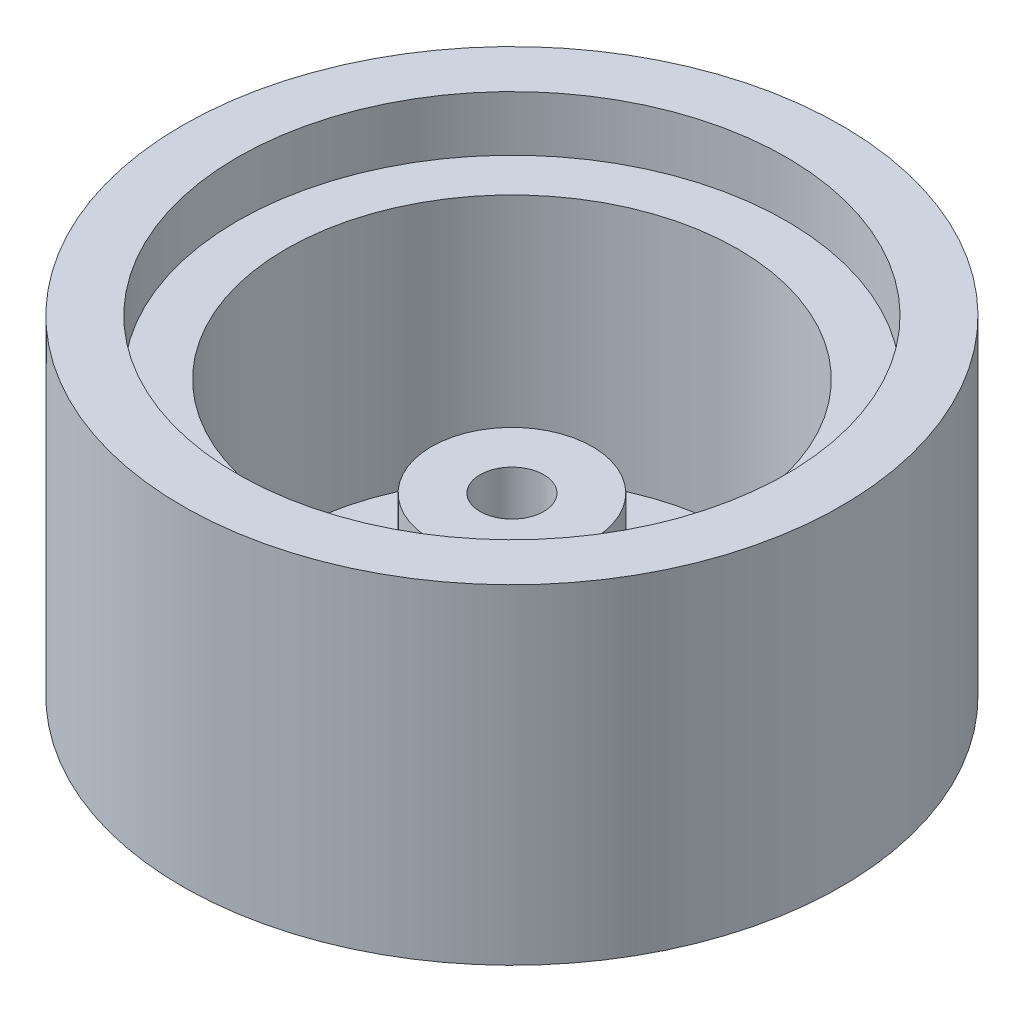
ISO-10303-21;
HEADER;
FILE_DESCRIPTION(('STEP AP214'),'2;1');
FILE_NAME('part.step','',(''),(''),'','','');
FILE_SCHEMA(('AUTOMOTIVE_DESIGN { 1 0 10303 214 1 1 1 1 }'));
ENDSEC;
DATA;
#1=APPLICATION_CONTEXT('core data for automotive mechanical design processes');
#2=APPLICATION_PROTOCOL_DEFINITION('international standard','automotive_design',2000,#1);
#3=PRODUCT_CONTEXT('',#1,'mechanical');
#4=PRODUCT('Part','Part','',(#3));
#5=PRODUCT_RELATED_PRODUCT_CATEGORY('part','',(#4));
#6=PRODUCT_DEFINITION_FORMATION('','',#4);
#7=PRODUCT_DEFINITION_CONTEXT('part definition',#1,'design');
#8=PRODUCT_DEFINITION('design','',#6,#7);
#9=PRODUCT_DEFINITION_SHAPE('','',#8);
#10=(LENGTH_UNIT() NAMED_UNIT(*) SI_UNIT(.MILLI.,.METRE.));
#11=(NAMED_UNIT(*) PLANE_ANGLE_UNIT() SI_UNIT($,.RADIAN.));
#12=(NAMED_UNIT(*) SI_UNIT($,.STERADIAN.) SOLID_ANGLE_UNIT());
#13=UNCERTAINTY_MEASURE_WITH_UNIT(LENGTH_MEASURE(1.E-05),#10,'distance_accuracy_value','');
#14=(GEOMETRIC_REPRESENTATION_CONTEXT(3) GLOBAL_UNCERTAINTY_ASSIGNED_CONTEXT((#13)) GLOBAL_UNIT_ASSIGNED_CONTEXT((#10,
#11,#12)) REPRESENTATION_CONTEXT('',''));
#15=CARTESIAN_POINT('',(0.,0.,0.));
#16=DIRECTION('',(0.,0.,1.));
#17=DIRECTION('',(1.,0.,0.));
#18=AXIS2_PLACEMENT_3D('',#15,#16,#17);
#19=CARTESIAN_POINT('',(0.,55.6945274823875,0.));
#20=DIRECTION('',(0.,1.,0.));
#21=DIRECTION('',(-1.,0.,0.));
#22=AXIS2_PLACEMENT_3D('',#19,#20,#21);
#23=CYLINDRICAL_SURFACE('',#22,2.95);
#24=CARTESIAN_POINT('',(0.,-13.1921209449324,0.));
#25=DIRECTION('',(0.,1.,0.));
#26=DIRECTION('',(-1.,0.,0.));
#27=AXIS2_PLACEMENT_3D('',#24,#25,#26);
#28=CIRCLE('',#27,2.95);
#29=CARTESIAN_POINT('',(-2.94999999999999,-13.1921209449324,0.));
#30=VERTEX_POINT('',#29);
#31=EDGE_CURVE('E10',#30,#30,#28,.T.);
#32=ORIENTED_EDGE('',*,*,#31,.F.);
#33=EDGE_LOOP('',(#32));
#34=FACE_BOUND('',#33,.T.);
#35=CARTESIAN_POINT('',(0.,3.08787905506758,0.));
#36=DIRECTION('',(0.,1.,0.));
#37=DIRECTION('',(-1.,0.,0.));
#38=AXIS2_PLACEMENT_3D('',#35,#36,#37);
#39=CIRCLE('',#38,2.94999999999999);
#40=CARTESIAN_POINT('',(-2.94999999999998,3.08787905506758,0.));
#41=VERTEX_POINT('',#40);
#42=EDGE_CURVE('E67',#41,#41,#39,.T.);
#43=ORIENTED_EDGE('',*,*,#42,.T.);
#44=EDGE_LOOP('',(#43));
#45=FACE_BOUND('',#44,.T.);
#46=ADVANCED_FACE('F33',(#34,#45),#23,.F.);
#47=CARTESIAN_POINT('',(2.95000000000001,-13.1921209449324,0.));
#48=DIRECTION('',(0.,1.,0.));
#49=DIRECTION('',(-1.,0.,0.));
#50=AXIS2_PLACEMENT_3D('',#47,#48,#49);
#51=PLANE('',#50);
#52=CARTESIAN_POINT('',(0.,-13.1921209449324,0.));
#53=DIRECTION('',(0.,1.,0.));
#54=DIRECTION('',(-1.,0.,0.));
#55=AXIS2_PLACEMENT_3D('',#52,#53,#54);
#56=CIRCLE('',#55,30.5);
#57=CARTESIAN_POINT('',(-30.5,-13.1921209449324,0.));
#58=VERTEX_POINT('',#57);
#59=EDGE_CURVE('E39',#58,#58,#56,.T.);
#60=ORIENTED_EDGE('',*,*,#59,.F.);
#61=EDGE_LOOP('',(#60));
#62=FACE_BOUND('',#61,.T.);
#63=ORIENTED_EDGE('',*,*,#31,.T.);
#64=EDGE_LOOP('',(#63));
#65=FACE_BOUND('',#64,.T.);
#66=ADVANCED_FACE('F116',(#62,#65),#51,.F.);
#67=CARTESIAN_POINT('',(0.,55.6945274823875,0.));
#68=DIRECTION('',(0.,1.,0.));
#69=DIRECTION('',(-1.,0.,0.));
#70=AXIS2_PLACEMENT_3D('',#67,#68,#69);
#71=CYLINDRICAL_SURFACE('',#70,30.5);
#72=CARTESIAN_POINT('',(0.,17.3078790550676,0.));
#73=DIRECTION('',(0.,1.,0.));
#74=DIRECTION('',(-1.,0.,0.));
#75=AXIS2_PLACEMENT_3D('',#72,#73,#74);
#76=CIRCLE('',#75,30.5);
#77=CARTESIAN_POINT('',(-30.5,17.3078790550676,0.));
#78=VERTEX_POINT('',#77);
#79=EDGE_CURVE('E43',#78,#78,#76,.T.);
#80=ORIENTED_EDGE('',*,*,#79,.F.);
#81=EDGE_LOOP('',(#80));
#82=FACE_BOUND('',#81,.T.);
#83=ORIENTED_EDGE('',*,*,#59,.T.);
#84=EDGE_LOOP('',(#83));
#85=FACE_BOUND('',#84,.T.);
#86=ADVANCED_FACE('F111',(#82,#85),#71,.T.);
#87=CARTESIAN_POINT('',(30.5,17.3078790550676,0.));
#88=DIRECTION('',(0.,-1.,0.));
#89=DIRECTION('',(1.,0.,0.));
#90=AXIS2_PLACEMENT_3D('',#87,#88,#89);
#91=PLANE('',#90);
#92=CARTESIAN_POINT('',(0.,17.3078790550676,0.));
#93=DIRECTION('',(0.,1.,0.));
#94=DIRECTION('',(-1.,0.,0.));
#95=AXIS2_PLACEMENT_3D('',#92,#93,#94);
#96=CIRCLE('',#95,25.4);
#97=CARTESIAN_POINT('',(-25.4,17.3078790550676,0.));
#98=VERTEX_POINT('',#97);
#99=EDGE_CURVE('E47',#98,#98,#96,.T.);
#100=ORIENTED_EDGE('',*,*,#99,.F.);
#101=EDGE_LOOP('',(#100));
#102=FACE_BOUND('',#101,.T.);
#103=ORIENTED_EDGE('',*,*,#79,.T.);
#104=EDGE_LOOP('',(#103));
#105=FACE_BOUND('',#104,.T.);
#106=ADVANCED_FACE('F105',(#102,#105),#91,.F.);
#107=CARTESIAN_POINT('',(0.,55.6945274823875,0.));
#108=DIRECTION('',(0.,1.,0.));
#109=DIRECTION('',(-1.,0.,0.));
#110=AXIS2_PLACEMENT_3D('',#107,#108,#109);
#111=CYLINDRICAL_SURFACE('',#110,25.4);
#112=CARTESIAN_POINT('',(0.,12.2078790550676,0.));
#113=DIRECTION('',(0.,1.,0.));
#114=DIRECTION('',(-1.,0.,0.));
#115=AXIS2_PLACEMENT_3D('',#112,#113,#114);
#116=CIRCLE('',#115,25.4);
#117=CARTESIAN_POINT('',(-25.4,12.2078790550676,0.));
#118=VERTEX_POINT('',#117);
#119=EDGE_CURVE('E52',#118,#118,#116,.T.);
#120=ORIENTED_EDGE('',*,*,#119,.F.);
#121=EDGE_LOOP('',(#120));
#122=FACE_BOUND('',#121,.T.);
#123=ORIENTED_EDGE('',*,*,#99,.T.);
#124=EDGE_LOOP('',(#123));
#125=FACE_BOUND('',#124,.T.);
#126=ADVANCED_FACE('F99',(#122,#125),#111,.F.);
#127=CARTESIAN_POINT('',(25.4,12.2078790550676,0.));
#128=DIRECTION('',(0.,-1.,0.));
#129=DIRECTION('',(1.,0.,0.));
#130=AXIS2_PLACEMENT_3D('',#127,#128,#129);
#131=PLANE('',#130);
#132=CARTESIAN_POINT('',(0.,12.2078790550676,0.));
#133=DIRECTION('',(0.,1.,0.));
#134=DIRECTION('',(-1.,0.,0.));
#135=AXIS2_PLACEMENT_3D('',#132,#133,#134);
#136=CIRCLE('',#135,20.9);
#137=CARTESIAN_POINT('',(-20.9,12.2078790550676,0.));
#138=VERTEX_POINT('',#137);
#139=EDGE_CURVE('E55',#138,#138,#136,.T.);
#140=ORIENTED_EDGE('',*,*,#139,.F.);
#141=EDGE_LOOP('',(#140));
#142=FACE_BOUND('',#141,.T.);
#143=ORIENTED_EDGE('',*,*,#119,.T.);
#144=EDGE_LOOP('',(#143));
#145=FACE_BOUND('',#144,.T.);
#146=ADVANCED_FACE('F93',(#142,#145),#131,.F.);
#147=CARTESIAN_POINT('',(0.,55.6945274823875,0.));
#148=DIRECTION('',(0.,1.,0.));
#149=DIRECTION('',(-1.,0.,0.));
#150=AXIS2_PLACEMENT_3D('',#147,#148,#149);
#151=CYLINDRICAL_SURFACE('',#150,20.9);
#152=CARTESIAN_POINT('',(0.,-10.5921209449324,0.));
#153=DIRECTION('',(0.,1.,0.));
#154=DIRECTION('',(-1.,0.,0.));
#155=AXIS2_PLACEMENT_3D('',#152,#153,#154);
#156=CIRCLE('',#155,20.9);
#157=CARTESIAN_POINT('',(-20.9,-10.5921209449324,0.));
#158=VERTEX_POINT('',#157);
#159=EDGE_CURVE('E58',#158,#158,#156,.T.);
#160=ORIENTED_EDGE('',*,*,#159,.F.);
#161=EDGE_LOOP('',(#160));
#162=FACE_BOUND('',#161,.T.);
#163=ORIENTED_EDGE('',*,*,#139,.T.);
#164=EDGE_LOOP('',(#163));
#165=FACE_BOUND('',#164,.T.);
#166=ADVANCED_FACE('F87',(#162,#165),#151,.F.);
#167=CARTESIAN_POINT('',(20.9,-10.5921209449324,0.));
#168=DIRECTION('',(0.,-1.,0.));
#169=DIRECTION('',(1.,0.,0.));
#170=AXIS2_PLACEMENT_3D('',#167,#168,#169);
#171=PLANE('',#170);
#172=CARTESIAN_POINT('',(0.,-10.5921209449324,0.));
#173=DIRECTION('',(0.,1.,0.));
#174=DIRECTION('',(-1.,0.,0.));
#175=AXIS2_PLACEMENT_3D('',#172,#173,#174);
#176=CIRCLE('',#175,7.44999999999999);
#177=CARTESIAN_POINT('',(-7.44999999999999,-10.5921209449324,0.));
#178=VERTEX_POINT('',#177);
#179=EDGE_CURVE('E61',#178,#178,#176,.T.);
#180=ORIENTED_EDGE('',*,*,#179,.F.);
#181=EDGE_LOOP('',(#180));
#182=FACE_BOUND('',#181,.T.);
#183=ORIENTED_EDGE('',*,*,#159,.T.);
#184=EDGE_LOOP('',(#183));
#185=FACE_BOUND('',#184,.T.);
#186=ADVANCED_FACE('F81',(#182,#185),#171,.F.);
#187=CARTESIAN_POINT('',(0.,55.6945274823875,0.));
#188=DIRECTION('',(0.,1.,0.));
#189=DIRECTION('',(-1.,0.,0.));
#190=AXIS2_PLACEMENT_3D('',#187,#188,#189);
#191=CYLINDRICAL_SURFACE('',#190,7.44999999999999);
#192=CARTESIAN_POINT('',(0.,3.08787905506759,0.));
#193=DIRECTION('',(0.,1.,0.));
#194=DIRECTION('',(-1.,0.,0.));
#195=AXIS2_PLACEMENT_3D('',#192,#193,#194);
#196=CIRCLE('',#195,7.44999999999999);
#197=CARTESIAN_POINT('',(-7.44999999999999,3.08787905506759,0.));
#198=VERTEX_POINT('',#197);
#199=EDGE_CURVE('E64',#198,#198,#196,.T.);
#200=ORIENTED_EDGE('',*,*,#199,.F.);
#201=EDGE_LOOP('',(#200));
#202=FACE_BOUND('',#201,.T.);
#203=ORIENTED_EDGE('',*,*,#179,.T.);
#204=EDGE_LOOP('',(#203));
#205=FACE_BOUND('',#204,.T.);
#206=ADVANCED_FACE('F75',(#202,#205),#191,.T.);
#207=CARTESIAN_POINT('',(7.45,3.08787905506759,0.));
#208=DIRECTION('',(0.,-1.,0.));
#209=DIRECTION('',(1.,0.,0.));
#210=AXIS2_PLACEMENT_3D('',#207,#208,#209);
#211=PLANE('',#210);
#212=ORIENTED_EDGE('',*,*,#42,.F.);
#213=EDGE_LOOP('',(#212));
#214=FACE_BOUND('',#213,.T.);
#215=ORIENTED_EDGE('',*,*,#199,.T.);
#216=EDGE_LOOP('',(#215));
#217=FACE_BOUND('',#216,.T.);
#218=ADVANCED_FACE('F72',(#214,#217),#211,.F.);
#219=CLOSED_SHELL('',(#46,#66,#86,#106,#126,#146,#166,#186,#206,#218));
#220=MANIFOLD_SOLID_BREP('B2',#219);
#221=ADVANCED_BREP_SHAPE_REPRESENTATION('',(#18,#220),#14);
#222=SHAPE_DEFINITION_REPRESENTATION(#9,#221);
ENDSEC;
END-ISO-10303-21;
